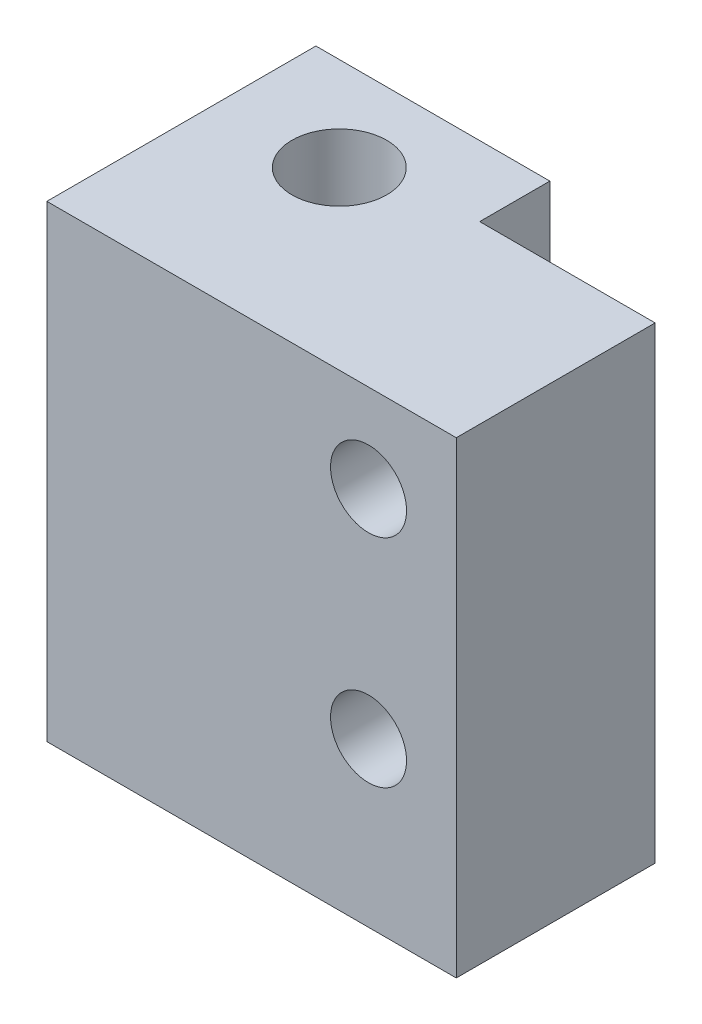
ISO-10303-21;
HEADER;
FILE_DESCRIPTION(('STEP AP214'),'2;1');
FILE_NAME('part.step','',(''),(''),'','','');
FILE_SCHEMA(('AUTOMOTIVE_DESIGN { 1 0 10303 214 1 1 1 1 }'));
ENDSEC;
DATA;
#1=APPLICATION_CONTEXT('core data for automotive mechanical design processes');
#2=APPLICATION_PROTOCOL_DEFINITION('international standard','automotive_design',2000,#1);
#3=PRODUCT_CONTEXT('',#1,'mechanical');
#4=PRODUCT('Part','Part','',(#3));
#5=PRODUCT_RELATED_PRODUCT_CATEGORY('part','',(#4));
#6=PRODUCT_DEFINITION_FORMATION('','',#4);
#7=PRODUCT_DEFINITION_CONTEXT('part definition',#1,'design');
#8=PRODUCT_DEFINITION('design','',#6,#7);
#9=PRODUCT_DEFINITION_SHAPE('','',#8);
#10=(LENGTH_UNIT() NAMED_UNIT(*) SI_UNIT(.MILLI.,.METRE.));
#11=(NAMED_UNIT(*) PLANE_ANGLE_UNIT() SI_UNIT($,.RADIAN.));
#12=(NAMED_UNIT(*) SI_UNIT($,.STERADIAN.) SOLID_ANGLE_UNIT());
#13=UNCERTAINTY_MEASURE_WITH_UNIT(LENGTH_MEASURE(1.E-05),#10,'distance_accuracy_value','');
#14=(GEOMETRIC_REPRESENTATION_CONTEXT(3) GLOBAL_UNCERTAINTY_ASSIGNED_CONTEXT((#13)) GLOBAL_UNIT_ASSIGNED_CONTEXT((#10,
#11,#12)) REPRESENTATION_CONTEXT('',''));
#15=CARTESIAN_POINT('',(0.,0.,0.));
#16=DIRECTION('',(0.,0.,1.));
#17=DIRECTION('',(1.,0.,0.));
#18=AXIS2_PLACEMENT_3D('',#15,#16,#17);
#19=CARTESIAN_POINT('',(-10.,-40.,22.257459708235));
#20=DIRECTION('',(0.,0.,-1.));
#21=DIRECTION('',(-1.,0.,0.));
#22=AXIS2_PLACEMENT_3D('',#19,#20,#21);
#23=PLANE('',#22);
#24=CARTESIAN_POINT('',(17.5,-7.53529097812589,22.257459708235));
#25=DIRECTION('',(0.,0.,1.));
#26=DIRECTION('',(-1.,0.,0.));
#27=AXIS2_PLACEMENT_3D('',#24,#25,#26);
#28=CIRCLE('',#27,3.25);
#29=CARTESIAN_POINT('',(14.25,-7.53529097812589,22.257459708235));
#30=VERTEX_POINT('',#29);
#31=EDGE_CURVE('E167',#30,#30,#28,.F.);
#32=ORIENTED_EDGE('',*,*,#31,.T.);
#33=EDGE_LOOP('',(#32));
#34=FACE_BOUND('',#33,.T.);
#35=CARTESIAN_POINT('',(17.5,-26.0457705473982,22.257459708235));
#36=DIRECTION('',(0.,0.,1.));
#37=DIRECTION('',(-1.,0.,0.));
#38=AXIS2_PLACEMENT_3D('',#35,#36,#37);
#39=CIRCLE('',#38,3.25);
#40=CARTESIAN_POINT('',(14.25,-26.0457705473982,22.257459708235));
#41=VERTEX_POINT('',#40);
#42=EDGE_CURVE('E170',#41,#41,#39,.F.);
#43=ORIENTED_EDGE('',*,*,#42,.T.);
#44=EDGE_LOOP('',(#43));
#45=FACE_BOUND('',#44,.T.);
#46=DIRECTION('',(1.,0.,0.));
#47=VECTOR('',#46,1.);
#48=CARTESIAN_POINT('',(-10.,0.,22.257459708235));
#49=LINE('',#48,#47);
#50=CARTESIAN_POINT('',(-10.,0.,22.257459708235));
#51=VERTEX_POINT('',#50);
#52=CARTESIAN_POINT('',(25.,0.,22.257459708235));
#53=VERTEX_POINT('',#52);
#54=EDGE_CURVE('E122',#51,#53,#49,.T.);
#55=ORIENTED_EDGE('',*,*,#54,.F.);
#56=DIRECTION('',(0.,1.,0.));
#57=VECTOR('',#56,1.);
#58=CARTESIAN_POINT('',(-10.,-40.,22.257459708235));
#59=LINE('',#58,#57);
#60=CARTESIAN_POINT('',(-10.,-40.,22.257459708235));
#61=VERTEX_POINT('',#60);
#62=EDGE_CURVE('E11',#61,#51,#59,.T.);
#63=ORIENTED_EDGE('',*,*,#62,.F.);
#64=DIRECTION('',(1.,0.,0.));
#65=VECTOR('',#64,1.);
#66=CARTESIAN_POINT('',(-10.,-40.,22.257459708235));
#67=LINE('',#66,#65);
#68=CARTESIAN_POINT('',(25.,-40.,22.257459708235));
#69=VERTEX_POINT('',#68);
#70=EDGE_CURVE('E116',#61,#69,#67,.T.);
#71=ORIENTED_EDGE('',*,*,#70,.T.);
#72=DIRECTION('',(0.,1.,0.));
#73=VECTOR('',#72,1.);
#74=CARTESIAN_POINT('',(25.,-40.,22.257459708235));
#75=LINE('',#74,#73);
#76=EDGE_CURVE('E45',#69,#53,#75,.T.);
#77=ORIENTED_EDGE('',*,*,#76,.T.);
#78=EDGE_LOOP('',(#55,#63,#71,#77));
#79=FACE_BOUND('',#78,.T.);
#80=ADVANCED_FACE('F36',(#34,#45,#79),#23,.F.);
#81=CARTESIAN_POINT('',(25.,-40.,5.25745970823498));
#82=DIRECTION('',(-1.,0.,0.));
#83=DIRECTION('',(0.,0.,1.));
#84=AXIS2_PLACEMENT_3D('',#81,#82,#83);
#85=PLANE('',#84);
#86=DIRECTION('',(0.,0.,-1.));
#87=VECTOR('',#86,1.);
#88=CARTESIAN_POINT('',(25.,0.,5.25745970823498));
#89=LINE('',#88,#87);
#90=CARTESIAN_POINT('',(25.,0.,5.25745970823498));
#91=VERTEX_POINT('',#90);
#92=EDGE_CURVE('E125',#53,#91,#89,.T.);
#93=ORIENTED_EDGE('',*,*,#92,.F.);
#94=ORIENTED_EDGE('',*,*,#76,.F.);
#95=DIRECTION('',(0.,0.,-1.));
#96=VECTOR('',#95,1.);
#97=CARTESIAN_POINT('',(25.,-40.,5.25745970823498));
#98=LINE('',#97,#96);
#99=CARTESIAN_POINT('',(25.,-40.,5.25745970823498));
#100=VERTEX_POINT('',#99);
#101=EDGE_CURVE('E114',#69,#100,#98,.T.);
#102=ORIENTED_EDGE('',*,*,#101,.T.);
#103=DIRECTION('',(0.,1.,0.));
#104=VECTOR('',#103,1.);
#105=CARTESIAN_POINT('',(25.,-40.,5.25745970823498));
#106=LINE('',#105,#104);
#107=EDGE_CURVE('E108',#100,#91,#106,.T.);
#108=ORIENTED_EDGE('',*,*,#107,.T.);
#109=EDGE_LOOP('',(#93,#94,#102,#108));
#110=FACE_BOUND('',#109,.T.);
#111=ADVANCED_FACE('F159',(#110),#85,.F.);
#112=CARTESIAN_POINT('',(10.,-40.,5.25745970823498));
#113=DIRECTION('',(0.,0.,1.));
#114=DIRECTION('',(1.,0.,0.));
#115=AXIS2_PLACEMENT_3D('',#112,#113,#114);
#116=PLANE('',#115);
#117=CARTESIAN_POINT('',(17.5,-7.53529097812589,5.25745970823498));
#118=DIRECTION('',(0.,0.,1.));
#119=DIRECTION('',(-1.,0.,0.));
#120=AXIS2_PLACEMENT_3D('',#117,#118,#119);
#121=CIRCLE('',#120,3.25);
#122=CARTESIAN_POINT('',(14.25,-7.53529097812589,5.25745970823498));
#123=VERTEX_POINT('',#122);
#124=EDGE_CURVE('E172',#123,#123,#121,.T.);
#125=ORIENTED_EDGE('',*,*,#124,.T.);
#126=EDGE_LOOP('',(#125));
#127=FACE_BOUND('',#126,.T.);
#128=CARTESIAN_POINT('',(17.5,-26.0457705473982,5.25745970823498));
#129=DIRECTION('',(0.,0.,1.));
#130=DIRECTION('',(-1.,0.,0.));
#131=AXIS2_PLACEMENT_3D('',#128,#129,#130);
#132=CIRCLE('',#131,3.25);
#133=CARTESIAN_POINT('',(14.25,-26.0457705473982,5.25745970823498));
#134=VERTEX_POINT('',#133);
#135=EDGE_CURVE('E173',#134,#134,#132,.T.);
#136=ORIENTED_EDGE('',*,*,#135,.T.);
#137=EDGE_LOOP('',(#136));
#138=FACE_BOUND('',#137,.T.);
#139=DIRECTION('',(-1.,0.,0.));
#140=VECTOR('',#139,1.);
#141=CARTESIAN_POINT('',(10.,0.,5.25745970823498));
#142=LINE('',#141,#140);
#143=CARTESIAN_POINT('',(10.,0.,5.25745970823498));
#144=VERTEX_POINT('',#143);
#145=EDGE_CURVE('E129',#91,#144,#142,.T.);
#146=ORIENTED_EDGE('',*,*,#145,.F.);
#147=ORIENTED_EDGE('',*,*,#107,.F.);
#148=DIRECTION('',(-1.,0.,0.));
#149=VECTOR('',#148,1.);
#150=CARTESIAN_POINT('',(10.,-40.,5.25745970823498));
#151=LINE('',#150,#149);
#152=CARTESIAN_POINT('',(10.,-40.,5.25745970823498));
#153=VERTEX_POINT('',#152);
#154=EDGE_CURVE('E95',#100,#153,#151,.T.);
#155=ORIENTED_EDGE('',*,*,#154,.T.);
#156=DIRECTION('',(0.,1.,0.));
#157=VECTOR('',#156,1.);
#158=CARTESIAN_POINT('',(10.,-40.,5.25745970823498));
#159=LINE('',#158,#157);
#160=EDGE_CURVE('E102',#153,#144,#159,.T.);
#161=ORIENTED_EDGE('',*,*,#160,.T.);
#162=EDGE_LOOP('',(#146,#147,#155,#161));
#163=FACE_BOUND('',#162,.T.);
#164=ADVANCED_FACE('F111',(#127,#138,#163),#116,.F.);
#165=CARTESIAN_POINT('',(10.,-40.,-0.742540291765022));
#166=DIRECTION('',(-1.,0.,0.));
#167=DIRECTION('',(0.,0.,1.));
#168=AXIS2_PLACEMENT_3D('',#165,#166,#167);
#169=PLANE('',#168);
#170=DIRECTION('',(0.,0.,-1.));
#171=VECTOR('',#170,1.);
#172=CARTESIAN_POINT('',(10.,0.,-0.742540291765022));
#173=LINE('',#172,#171);
#174=CARTESIAN_POINT('',(10.,0.,-0.742540291765022));
#175=VERTEX_POINT('',#174);
#176=EDGE_CURVE('E105',#144,#175,#173,.T.);
#177=ORIENTED_EDGE('',*,*,#176,.F.);
#178=ORIENTED_EDGE('',*,*,#160,.F.);
#179=DIRECTION('',(0.,0.,-1.));
#180=VECTOR('',#179,1.);
#181=CARTESIAN_POINT('',(10.,-40.,-0.742540291765022));
#182=LINE('',#181,#180);
#183=CARTESIAN_POINT('',(10.,-40.,-0.742540291765022));
#184=VERTEX_POINT('',#183);
#185=EDGE_CURVE('E91',#153,#184,#182,.T.);
#186=ORIENTED_EDGE('',*,*,#185,.T.);
#187=DIRECTION('',(0.,1.,0.));
#188=VECTOR('',#187,1.);
#189=CARTESIAN_POINT('',(10.,-40.,-0.742540291765022));
#190=LINE('',#189,#188);
#191=EDGE_CURVE('E109',#184,#175,#190,.T.);
#192=ORIENTED_EDGE('',*,*,#191,.T.);
#193=EDGE_LOOP('',(#177,#178,#186,#192));
#194=FACE_BOUND('',#193,.T.);
#195=ADVANCED_FACE('F103',(#194),#169,.F.);
#196=CARTESIAN_POINT('',(-10.,-40.,-0.742540291765022));
#197=DIRECTION('',(0.,0.,1.));
#198=DIRECTION('',(1.,0.,0.));
#199=AXIS2_PLACEMENT_3D('',#196,#197,#198);
#200=PLANE('',#199);
#201=DIRECTION('',(-1.,0.,0.));
#202=VECTOR('',#201,1.);
#203=CARTESIAN_POINT('',(-10.,0.,-0.742540291765022));
#204=LINE('',#203,#202);
#205=CARTESIAN_POINT('',(-10.,0.,-0.742540291765022));
#206=VERTEX_POINT('',#205);
#207=EDGE_CURVE('E76',#175,#206,#204,.T.);
#208=ORIENTED_EDGE('',*,*,#207,.F.);
#209=ORIENTED_EDGE('',*,*,#191,.F.);
#210=DIRECTION('',(-1.,0.,0.));
#211=VECTOR('',#210,1.);
#212=CARTESIAN_POINT('',(-10.,-40.,-0.742540291765022));
#213=LINE('',#212,#211);
#214=CARTESIAN_POINT('',(-10.,-40.,-0.742540291765022));
#215=VERTEX_POINT('',#214);
#216=EDGE_CURVE('E98',#184,#215,#213,.T.);
#217=ORIENTED_EDGE('',*,*,#216,.T.);
#218=DIRECTION('',(0.,1.,0.));
#219=VECTOR('',#218,1.);
#220=CARTESIAN_POINT('',(-10.,-40.,-0.742540291765022));
#221=LINE('',#220,#219);
#222=EDGE_CURVE('E121',#215,#206,#221,.T.);
#223=ORIENTED_EDGE('',*,*,#222,.T.);
#224=EDGE_LOOP('',(#208,#209,#217,#223));
#225=FACE_BOUND('',#224,.T.);
#226=ADVANCED_FACE('F148',(#225),#200,.F.);
#227=CARTESIAN_POINT('',(-10.,-40.,5.25745970823498));
#228=DIRECTION('',(1.,0.,0.));
#229=DIRECTION('',(0.,0.,-1.));
#230=AXIS2_PLACEMENT_3D('',#227,#228,#229);
#231=PLANE('',#230);
#232=DIRECTION('',(0.,0.,1.));
#233=VECTOR('',#232,1.);
#234=CARTESIAN_POINT('',(-10.,0.,5.25745970823498));
#235=LINE('',#234,#233);
#236=EDGE_CURVE('E81',#206,#51,#235,.T.);
#237=ORIENTED_EDGE('',*,*,#236,.F.);
#238=ORIENTED_EDGE('',*,*,#222,.F.);
#239=DIRECTION('',(0.,0.,1.));
#240=VECTOR('',#239,1.);
#241=CARTESIAN_POINT('',(-10.,-40.,5.25745970823498));
#242=LINE('',#241,#240);
#243=EDGE_CURVE('E53',#215,#61,#242,.T.);
#244=ORIENTED_EDGE('',*,*,#243,.T.);
#245=ORIENTED_EDGE('',*,*,#62,.T.);
#246=EDGE_LOOP('',(#237,#238,#244,#245));
#247=FACE_BOUND('',#246,.T.);
#248=ADVANCED_FACE('F146',(#247),#231,.F.);
#249=CARTESIAN_POINT('',(0.,-40.,0.));
#250=DIRECTION('',(0.,-1.,0.));
#251=DIRECTION('',(0.,0.,1.));
#252=AXIS2_PLACEMENT_3D('',#249,#250,#251);
#253=PLANE('',#252);
#254=CARTESIAN_POINT('',(0.,-40.,7.25745970823498));
#255=DIRECTION('',(0.,1.,0.));
#256=DIRECTION('',(0.,0.,1.));
#257=AXIS2_PLACEMENT_3D('',#254,#255,#256);
#258=CIRCLE('',#257,1.5);
#259=CARTESIAN_POINT('',(0.,-40.,8.75745970823498));
#260=VERTEX_POINT('',#259);
#261=EDGE_CURVE('E39',#260,#260,#258,.T.);
#262=ORIENTED_EDGE('',*,*,#261,.T.);
#263=EDGE_LOOP('',(#262));
#264=FACE_BOUND('',#263,.T.);
#265=ORIENTED_EDGE('',*,*,#243,.F.);
#266=ORIENTED_EDGE('',*,*,#216,.F.);
#267=ORIENTED_EDGE('',*,*,#185,.F.);
#268=ORIENTED_EDGE('',*,*,#154,.F.);
#269=ORIENTED_EDGE('',*,*,#101,.F.);
#270=ORIENTED_EDGE('',*,*,#70,.F.);
#271=EDGE_LOOP('',(#265,#266,#267,#268,#269,#270));
#272=FACE_BOUND('',#271,.T.);
#273=ADVANCED_FACE('F93',(#264,#272),#253,.T.);
#274=CARTESIAN_POINT('',(0.,0.,0.));
#275=DIRECTION('',(0.,-1.,0.));
#276=DIRECTION('',(0.,0.,1.));
#277=AXIS2_PLACEMENT_3D('',#274,#275,#276);
#278=PLANE('',#277);
#279=CARTESIAN_POINT('',(0.,0.,7.25745970823498));
#280=DIRECTION('',(0.,-1.,0.));
#281=DIRECTION('',(0.,0.,-1.));
#282=AXIS2_PLACEMENT_3D('',#279,#280,#281);
#283=CIRCLE('',#282,4.05);
#284=CARTESIAN_POINT('',(0.,0.,3.20745970823498));
#285=VERTEX_POINT('',#284);
#286=EDGE_CURVE('E183',#285,#285,#283,.T.);
#287=ORIENTED_EDGE('',*,*,#286,.T.);
#288=EDGE_LOOP('',(#287));
#289=FACE_BOUND('',#288,.T.);
#290=ORIENTED_EDGE('',*,*,#54,.T.);
#291=ORIENTED_EDGE('',*,*,#92,.T.);
#292=ORIENTED_EDGE('',*,*,#145,.T.);
#293=ORIENTED_EDGE('',*,*,#176,.T.);
#294=ORIENTED_EDGE('',*,*,#207,.T.);
#295=ORIENTED_EDGE('',*,*,#236,.T.);
#296=EDGE_LOOP('',(#290,#291,#292,#293,#294,#295));
#297=FACE_BOUND('',#296,.T.);
#298=ADVANCED_FACE('F145',(#289,#297),#278,.F.);
#299=CARTESIAN_POINT('',(0.,-35.,7.25745970823498));
#300=DIRECTION('',(0.,1.,0.));
#301=DIRECTION('',(0.,0.,-1.));
#302=AXIS2_PLACEMENT_3D('',#299,#300,#301);
#303=CYLINDRICAL_SURFACE('',#302,4.05);
#304=CARTESIAN_POINT('',(0.,-35.,7.25745970823498));
#305=DIRECTION('',(0.,-1.,0.));
#306=DIRECTION('',(0.,0.,-1.));
#307=AXIS2_PLACEMENT_3D('',#304,#305,#306);
#308=CIRCLE('',#307,4.05);
#309=CARTESIAN_POINT('',(0.,-35.,3.20745970823498));
#310=VERTEX_POINT('',#309);
#311=EDGE_CURVE('E126',#310,#310,#308,.T.);
#312=ORIENTED_EDGE('',*,*,#311,.T.);
#313=EDGE_LOOP('',(#312));
#314=FACE_BOUND('',#313,.T.);
#315=ORIENTED_EDGE('',*,*,#286,.F.);
#316=EDGE_LOOP('',(#315));
#317=FACE_BOUND('',#316,.T.);
#318=ADVANCED_FACE('F214',(#314,#317),#303,.F.);
#319=CARTESIAN_POINT('',(0.,-35.,7.25745970823498));
#320=DIRECTION('',(0.,1.,0.));
#321=DIRECTION('',(0.,0.,-1.));
#322=AXIS2_PLACEMENT_3D('',#319,#320,#321);
#323=PLANE('',#322);
#324=CARTESIAN_POINT('',(0.,-35.,7.25745970823498));
#325=DIRECTION('',(0.,-1.,0.));
#326=DIRECTION('',(0.,0.,-1.));
#327=AXIS2_PLACEMENT_3D('',#324,#325,#326);
#328=CIRCLE('',#327,1.5);
#329=CARTESIAN_POINT('',(0.,-35.,5.75745970823498));
#330=VERTEX_POINT('',#329);
#331=EDGE_CURVE('E189',#330,#330,#328,.T.);
#332=ORIENTED_EDGE('',*,*,#331,.T.);
#333=EDGE_LOOP('',(#332));
#334=FACE_BOUND('',#333,.T.);
#335=ORIENTED_EDGE('',*,*,#311,.F.);
#336=EDGE_LOOP('',(#335));
#337=FACE_BOUND('',#336,.T.);
#338=ADVANCED_FACE('F210',(#334,#337),#323,.T.);
#339=CARTESIAN_POINT('',(17.5,-26.0457705473982,22.258459708235));
#340=DIRECTION('',(0.,0.,-1.));
#341=DIRECTION('',(-1.,0.,0.));
#342=AXIS2_PLACEMENT_3D('',#339,#340,#341);
#343=CYLINDRICAL_SURFACE('',#342,3.25);
#344=ORIENTED_EDGE('',*,*,#135,.F.);
#345=EDGE_LOOP('',(#344));
#346=FACE_BOUND('',#345,.T.);
#347=ORIENTED_EDGE('',*,*,#42,.F.);
#348=EDGE_LOOP('',(#347));
#349=FACE_BOUND('',#348,.T.);
#350=ADVANCED_FACE('F204',(#346,#349),#343,.F.);
#351=CARTESIAN_POINT('',(17.5,-7.53529097812589,22.258459708235));
#352=DIRECTION('',(0.,0.,-1.));
#353=DIRECTION('',(-1.,0.,0.));
#354=AXIS2_PLACEMENT_3D('',#351,#352,#353);
#355=CYLINDRICAL_SURFACE('',#354,3.25);
#356=ORIENTED_EDGE('',*,*,#124,.F.);
#357=EDGE_LOOP('',(#356));
#358=FACE_BOUND('',#357,.T.);
#359=ORIENTED_EDGE('',*,*,#31,.F.);
#360=EDGE_LOOP('',(#359));
#361=FACE_BOUND('',#360,.T.);
#362=ADVANCED_FACE('F199',(#358,#361),#355,.F.);
#363=CARTESIAN_POINT('',(0.,-45.,7.25745970823498));
#364=DIRECTION('',(0.,1.,0.));
#365=DIRECTION('',(0.,0.,-1.));
#366=AXIS2_PLACEMENT_3D('',#363,#364,#365);
#367=CYLINDRICAL_SURFACE('',#366,1.5);
#368=ORIENTED_EDGE('',*,*,#261,.F.);
#369=EDGE_LOOP('',(#368));
#370=FACE_BOUND('',#369,.T.);
#371=ORIENTED_EDGE('',*,*,#331,.F.);
#372=EDGE_LOOP('',(#371));
#373=FACE_BOUND('',#372,.T.);
#374=ADVANCED_FACE('F196',(#370,#373),#367,.F.);
#375=CLOSED_SHELL('',(#80,#111,#164,#195,#226,#248,#273,#298,#318,#338,#350,#362,#374));
#376=MANIFOLD_SOLID_BREP('B2',#375);
#377=ADVANCED_BREP_SHAPE_REPRESENTATION('',(#18,#376),#14);
#378=SHAPE_DEFINITION_REPRESENTATION(#9,#377);
ENDSEC;
END-ISO-10303-21;
